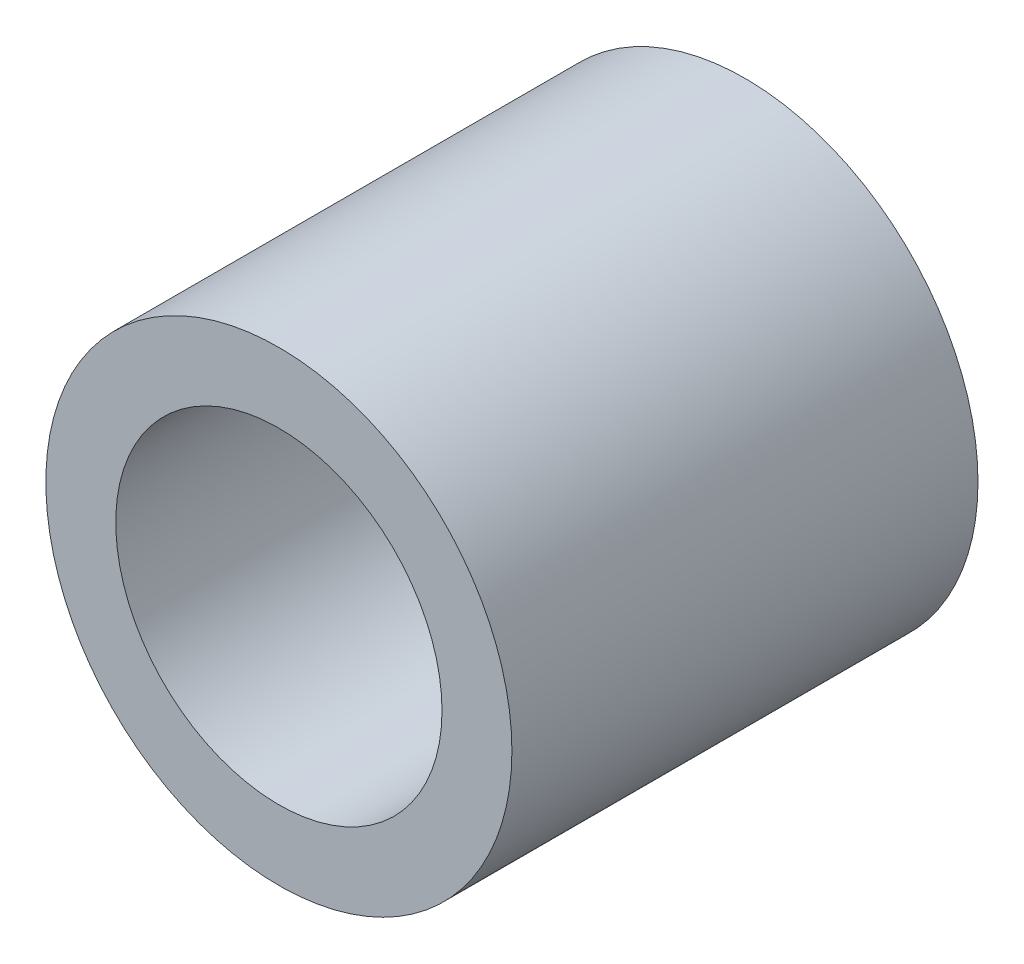
ISO-10303-21;
HEADER;
FILE_DESCRIPTION(('STEP AP214'),'2;1');
FILE_NAME('part.step','',(''),(''),'','','');
FILE_SCHEMA(('AUTOMOTIVE_DESIGN { 1 0 10303 214 1 1 1 1 }'));
ENDSEC;
DATA;
#1=APPLICATION_CONTEXT('core data for automotive mechanical design processes');
#2=APPLICATION_PROTOCOL_DEFINITION('international standard','automotive_design',2000,#1);
#3=PRODUCT_CONTEXT('',#1,'mechanical');
#4=PRODUCT('Part','Part','',(#3));
#5=PRODUCT_RELATED_PRODUCT_CATEGORY('part','',(#4));
#6=PRODUCT_DEFINITION_FORMATION('','',#4);
#7=PRODUCT_DEFINITION_CONTEXT('part definition',#1,'design');
#8=PRODUCT_DEFINITION('design','',#6,#7);
#9=PRODUCT_DEFINITION_SHAPE('','',#8);
#10=(LENGTH_UNIT() NAMED_UNIT(*) SI_UNIT(.MILLI.,.METRE.));
#11=(NAMED_UNIT(*) PLANE_ANGLE_UNIT() SI_UNIT($,.RADIAN.));
#12=(NAMED_UNIT(*) SI_UNIT($,.STERADIAN.) SOLID_ANGLE_UNIT());
#13=UNCERTAINTY_MEASURE_WITH_UNIT(LENGTH_MEASURE(1.E-05),#10,'distance_accuracy_value','');
#14=(GEOMETRIC_REPRESENTATION_CONTEXT(3) GLOBAL_UNCERTAINTY_ASSIGNED_CONTEXT((#13)) GLOBAL_UNIT_ASSIGNED_CONTEXT((#10,
#11,#12)) REPRESENTATION_CONTEXT('',''));
#15=CARTESIAN_POINT('',(0.,0.,0.));
#16=DIRECTION('',(0.,0.,1.));
#17=DIRECTION('',(1.,0.,0.));
#18=AXIS2_PLACEMENT_3D('',#15,#16,#17);
#19=CARTESIAN_POINT('',(0.,0.,20.));
#20=DIRECTION('',(0.,0.,-1.));
#21=DIRECTION('',(-1.,0.,0.));
#22=AXIS2_PLACEMENT_3D('',#19,#20,#21);
#23=CYLINDRICAL_SURFACE('',#22,10.);
#24=CARTESIAN_POINT('',(0.,0.,20.));
#25=DIRECTION('',(0.,0.,1.));
#26=DIRECTION('',(1.,0.,0.));
#27=AXIS2_PLACEMENT_3D('',#24,#25,#26);
#28=CIRCLE('',#27,10.);
#29=CARTESIAN_POINT('',(10.,0.,20.));
#30=VERTEX_POINT('',#29);
#31=EDGE_CURVE('E10',#30,#30,#28,.T.);
#32=ORIENTED_EDGE('',*,*,#31,.F.);
#33=EDGE_LOOP('',(#32));
#34=FACE_BOUND('',#33,.T.);
#35=CARTESIAN_POINT('',(0.,0.,0.));
#36=DIRECTION('',(0.,0.,1.));
#37=DIRECTION('',(1.,0.,0.));
#38=AXIS2_PLACEMENT_3D('',#35,#36,#37);
#39=CIRCLE('',#38,10.);
#40=CARTESIAN_POINT('',(10.,0.,0.));
#41=VERTEX_POINT('',#40);
#42=EDGE_CURVE('E36',#41,#41,#39,.T.);
#43=ORIENTED_EDGE('',*,*,#42,.T.);
#44=EDGE_LOOP('',(#43));
#45=FACE_BOUND('',#44,.T.);
#46=ADVANCED_FACE('F33',(#34,#45),#23,.T.);
#47=CARTESIAN_POINT('',(0.,0.,20.));
#48=DIRECTION('',(0.,0.,1.));
#49=DIRECTION('',(1.,0.,0.));
#50=AXIS2_PLACEMENT_3D('',#47,#48,#49);
#51=PLANE('',#50);
#52=CARTESIAN_POINT('',(0.,0.,20.));
#53=DIRECTION('',(0.,0.,1.));
#54=DIRECTION('',(1.,0.,0.));
#55=AXIS2_PLACEMENT_3D('',#52,#53,#54);
#56=CIRCLE('',#55,7.);
#57=CARTESIAN_POINT('',(7.,0.,20.));
#58=VERTEX_POINT('',#57);
#59=EDGE_CURVE('E43',#58,#58,#56,.F.);
#60=ORIENTED_EDGE('',*,*,#59,.T.);
#61=EDGE_LOOP('',(#60));
#62=FACE_BOUND('',#61,.T.);
#63=ORIENTED_EDGE('',*,*,#31,.T.);
#64=EDGE_LOOP('',(#63));
#65=FACE_BOUND('',#64,.T.);
#66=ADVANCED_FACE('F61',(#62,#65),#51,.T.);
#67=CARTESIAN_POINT('',(0.,0.,0.));
#68=DIRECTION('',(0.,0.,1.));
#69=DIRECTION('',(1.,0.,0.));
#70=AXIS2_PLACEMENT_3D('',#67,#68,#69);
#71=PLANE('',#70);
#72=CARTESIAN_POINT('',(0.,0.,0.));
#73=DIRECTION('',(0.,0.,1.));
#74=DIRECTION('',(1.,0.,0.));
#75=AXIS2_PLACEMENT_3D('',#72,#73,#74);
#76=CIRCLE('',#75,7.);
#77=CARTESIAN_POINT('',(7.,0.,0.));
#78=VERTEX_POINT('',#77);
#79=EDGE_CURVE('E47',#78,#78,#76,.T.);
#80=ORIENTED_EDGE('',*,*,#79,.T.);
#81=EDGE_LOOP('',(#80));
#82=FACE_BOUND('',#81,.T.);
#83=ORIENTED_EDGE('',*,*,#42,.F.);
#84=EDGE_LOOP('',(#83));
#85=FACE_BOUND('',#84,.T.);
#86=ADVANCED_FACE('F51',(#82,#85),#71,.F.);
#87=CARTESIAN_POINT('',(0.,0.,35.));
#88=DIRECTION('',(0.,0.,-1.));
#89=DIRECTION('',(-1.,0.,0.));
#90=AXIS2_PLACEMENT_3D('',#87,#88,#89);
#91=CYLINDRICAL_SURFACE('',#90,7.);
#92=ORIENTED_EDGE('',*,*,#59,.F.);
#93=EDGE_LOOP('',(#92));
#94=FACE_BOUND('',#93,.T.);
#95=ORIENTED_EDGE('',*,*,#79,.F.);
#96=EDGE_LOOP('',(#95));
#97=FACE_BOUND('',#96,.T.);
#98=ADVANCED_FACE('F54',(#94,#97),#91,.F.);
#99=CLOSED_SHELL('',(#46,#66,#86,#98));
#100=MANIFOLD_SOLID_BREP('B2',#99);
#101=ADVANCED_BREP_SHAPE_REPRESENTATION('',(#18,#100),#14);
#102=SHAPE_DEFINITION_REPRESENTATION(#9,#101);
ENDSEC;
END-ISO-10303-21;
